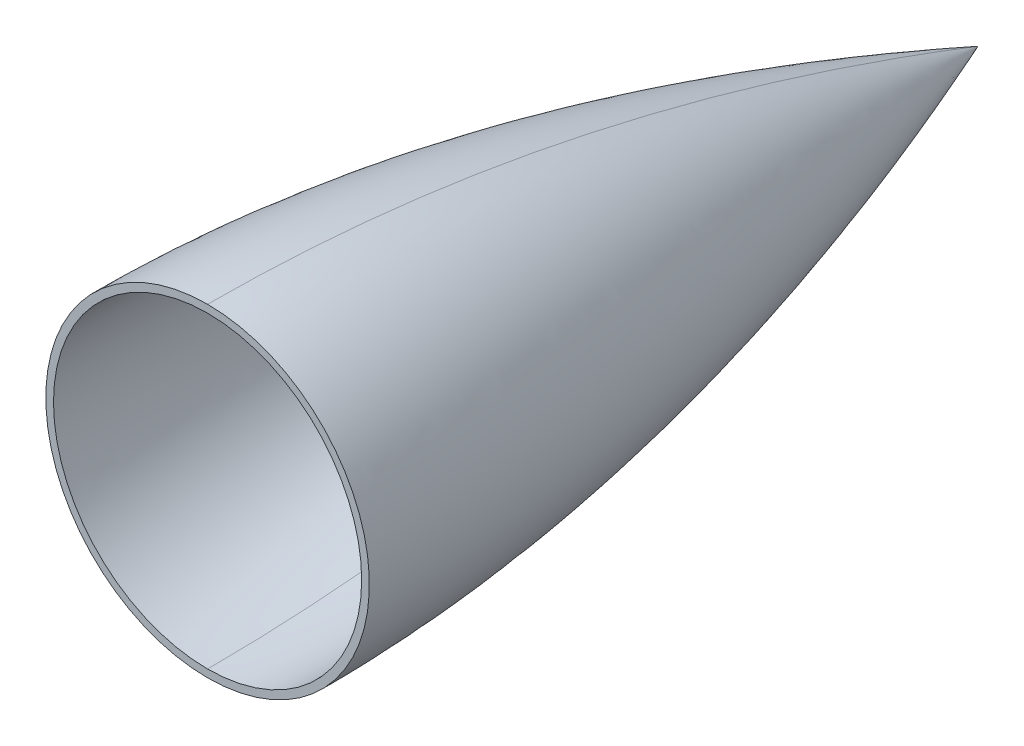
ISO-10303-21;
HEADER;
FILE_DESCRIPTION(('STEP AP214'),'2;1');
FILE_NAME('part.step','',(''),(''),'','','');
FILE_SCHEMA(('AUTOMOTIVE_DESIGN { 1 0 10303 214 1 1 1 1 }'));
ENDSEC;
DATA;
#1=APPLICATION_CONTEXT('core data for automotive mechanical design processes');
#2=APPLICATION_PROTOCOL_DEFINITION('international standard','automotive_design',2000,#1);
#3=PRODUCT_CONTEXT('',#1,'mechanical');
#4=PRODUCT('Part','Part','',(#3));
#5=PRODUCT_RELATED_PRODUCT_CATEGORY('part','',(#4));
#6=PRODUCT_DEFINITION_FORMATION('','',#4);
#7=PRODUCT_DEFINITION_CONTEXT('part definition',#1,'design');
#8=PRODUCT_DEFINITION('design','',#6,#7);
#9=PRODUCT_DEFINITION_SHAPE('','',#8);
#10=(LENGTH_UNIT() NAMED_UNIT(*) SI_UNIT(.MILLI.,.METRE.));
#11=(NAMED_UNIT(*) PLANE_ANGLE_UNIT() SI_UNIT($,.RADIAN.));
#12=(NAMED_UNIT(*) SI_UNIT($,.STERADIAN.) SOLID_ANGLE_UNIT());
#13=UNCERTAINTY_MEASURE_WITH_UNIT(LENGTH_MEASURE(1.E-05),#10,'distance_accuracy_value','');
#14=(GEOMETRIC_REPRESENTATION_CONTEXT(3) GLOBAL_UNCERTAINTY_ASSIGNED_CONTEXT((#13)) GLOBAL_UNIT_ASSIGNED_CONTEXT((#10,
#11,#12)) REPRESENTATION_CONTEXT('',''));
#15=CARTESIAN_POINT('',(0.,0.,0.));
#16=DIRECTION('',(0.,0.,1.));
#17=DIRECTION('',(1.,0.,0.));
#18=AXIS2_PLACEMENT_3D('',#15,#16,#17);
#19=CARTESIAN_POINT('',(-8.,-17.9999999839829,-90.0000000060439));
#20=DIRECTION('',(0.,-1.77968750847413E-10,1.));
#21=DIRECTION('',(0.,-1.,-1.77968750847413E-10));
#22=AXIS2_PLACEMENT_3D('',#19,#20,#21);
#23=CYLINDRICAL_SURFACE('',#22,1.5);
#24=DIRECTION('',(0.,-1.77967594365095E-10,1.));
#25=VECTOR('',#24,1.);
#26=CARTESIAN_POINT('',(-8.,-16.4999999839829,-90.0000000057769));
#27=LINE('',#26,#25);
#28=CARTESIAN_POINT('',(-8.,-16.4999999839829,-90.0000000057769));
#29=VERTEX_POINT('',#28);
#30=CARTESIAN_POINT('',(-8.,-16.4999999848728,-85.0000000057769));
#31=VERTEX_POINT('',#30);
#32=EDGE_CURVE('E163',#29,#31,#27,.T.);
#33=ORIENTED_EDGE('',*,*,#32,.F.);
#34=CARTESIAN_POINT('',(-8.,-17.9999999839829,-90.0000000060439));
#35=DIRECTION('',(0.,-1.77968750847413E-10,1.));
#36=DIRECTION('',(0.,-1.,-1.77968750847413E-10));
#37=AXIS2_PLACEMENT_3D('',#34,#35,#36);
#38=CIRCLE('',#37,1.5);
#39=CARTESIAN_POINT('',(-8.,-19.4999999839829,-90.0000000063108));
#40=VERTEX_POINT('',#39);
#41=EDGE_CURVE('E10',#40,#29,#38,.T.);
#42=ORIENTED_EDGE('',*,*,#41,.F.);
#43=DIRECTION('',(0.,-1.77967594365095E-10,1.));
#44=VECTOR('',#43,1.);
#45=CARTESIAN_POINT('',(-8.,-19.4999999839829,-90.0000000063108));
#46=LINE('',#45,#44);
#47=CARTESIAN_POINT('',(-8.,-19.4999999848728,-85.0000000063108));
#48=VERTEX_POINT('',#47);
#49=EDGE_CURVE('E155',#40,#48,#46,.T.);
#50=ORIENTED_EDGE('',*,*,#49,.T.);
#51=CARTESIAN_POINT('',(-8.,-17.9999999848728,-85.0000000060439));
#52=DIRECTION('',(0.,1.77968750847413E-10,-1.));
#53=DIRECTION('',(0.,-1.,-1.77968750847413E-10));
#54=AXIS2_PLACEMENT_3D('',#51,#52,#53);
#55=CIRCLE('',#54,1.5);
#56=EDGE_CURVE('E141',#31,#48,#55,.T.);
#57=ORIENTED_EDGE('',*,*,#56,.F.);
#58=EDGE_LOOP('',(#33,#42,#50,#57));
#59=FACE_BOUND('',#58,.T.);
#60=ADVANCED_FACE('F16',(#59),#23,.F.);
#61=CARTESIAN_POINT('',(0.,1.60170822374376E-08,-90.0000000028405));
#62=DIRECTION('',(0.,-1.77967577619409E-10,1.));
#63=DIRECTION('',(-1.,0.,0.));
#64=AXIS2_PLACEMENT_3D('',#61,#62,#63);
#65=PLANE('',#64);
#66=ORIENTED_EDGE('',*,*,#41,.T.);
#67=CARTESIAN_POINT('',(-8.,-17.9999999839829,-90.0000000060439));
#68=DIRECTION('',(0.,-1.77968750847413E-10,1.));
#69=DIRECTION('',(0.,-1.,-1.77968750847413E-10));
#70=AXIS2_PLACEMENT_3D('',#67,#68,#69);
#71=CIRCLE('',#70,1.5);
#72=EDGE_CURVE('E170',#29,#40,#71,.T.);
#73=ORIENTED_EDGE('',*,*,#72,.T.);
#74=EDGE_LOOP('',(#66,#73));
#75=FACE_BOUND('',#74,.T.);
#76=ADVANCED_FACE('F300',(#75),#65,.T.);
#77=CARTESIAN_POINT('',(8.,18.0000000160171,-89.9999999996371));
#78=DIRECTION('',(0.,-1.77968750847413E-10,1.));
#79=DIRECTION('',(0.,-1.,-1.77968750847413E-10));
#80=AXIS2_PLACEMENT_3D('',#77,#78,#79);
#81=CYLINDRICAL_SURFACE('',#80,1.5);
#82=DIRECTION('',(0.,-1.77967594365095E-10,1.));
#83=VECTOR('',#82,1.);
#84=CARTESIAN_POINT('',(8.,19.5000000160171,-89.9999999993701));
#85=LINE('',#84,#83);
#86=CARTESIAN_POINT('',(8.,19.5000000160171,-89.9999999993701));
#87=VERTEX_POINT('',#86);
#88=CARTESIAN_POINT('',(8.,19.5000000151272,-84.9999999993701));
#89=VERTEX_POINT('',#88);
#90=EDGE_CURVE('E218',#87,#89,#85,.T.);
#91=ORIENTED_EDGE('',*,*,#90,.F.);
#92=CARTESIAN_POINT('',(8.,18.0000000160171,-89.9999999996371));
#93=DIRECTION('',(0.,-1.77968750847413E-10,1.));
#94=DIRECTION('',(0.,-1.,-1.77968750847413E-10));
#95=AXIS2_PLACEMENT_3D('',#92,#93,#94);
#96=CIRCLE('',#95,1.5);
#97=CARTESIAN_POINT('',(8.,16.5000000160171,-89.999999999904));
#98=VERTEX_POINT('',#97);
#99=EDGE_CURVE('E29',#98,#87,#96,.T.);
#100=ORIENTED_EDGE('',*,*,#99,.F.);
#101=DIRECTION('',(0.,-1.77967594365095E-10,1.));
#102=VECTOR('',#101,1.);
#103=CARTESIAN_POINT('',(8.,16.5000000160171,-89.999999999904));
#104=LINE('',#103,#102);
#105=CARTESIAN_POINT('',(8.,16.5000000151273,-84.999999999904));
#106=VERTEX_POINT('',#105);
#107=EDGE_CURVE('E212',#98,#106,#104,.T.);
#108=ORIENTED_EDGE('',*,*,#107,.T.);
#109=CARTESIAN_POINT('',(8.,18.0000000151272,-84.999999999637));
#110=DIRECTION('',(0.,1.77968750847413E-10,-1.));
#111=DIRECTION('',(0.,-1.,-1.77968750847413E-10));
#112=AXIS2_PLACEMENT_3D('',#109,#110,#111);
#113=CIRCLE('',#112,1.5);
#114=EDGE_CURVE('E77',#89,#106,#113,.T.);
#115=ORIENTED_EDGE('',*,*,#114,.F.);
#116=EDGE_LOOP('',(#91,#100,#108,#115));
#117=FACE_BOUND('',#116,.T.);
#118=ADVANCED_FACE('F18',(#117),#81,.F.);
#119=CARTESIAN_POINT('',(0.,1.60170822374376E-08,-90.0000000028405));
#120=DIRECTION('',(0.,-1.77967577619409E-10,1.));
#121=DIRECTION('',(-1.,0.,0.));
#122=AXIS2_PLACEMENT_3D('',#119,#120,#121);
#123=PLANE('',#122);
#124=ORIENTED_EDGE('',*,*,#99,.T.);
#125=CARTESIAN_POINT('',(8.,18.0000000160171,-89.9999999996371));
#126=DIRECTION('',(0.,-1.77968750847413E-10,1.));
#127=DIRECTION('',(0.,-1.,-1.77968750847413E-10));
#128=AXIS2_PLACEMENT_3D('',#125,#126,#127);
#129=CIRCLE('',#128,1.5);
#130=EDGE_CURVE('E160',#87,#98,#129,.T.);
#131=ORIENTED_EDGE('',*,*,#130,.T.);
#132=EDGE_LOOP('',(#124,#131));
#133=FACE_BOUND('',#132,.T.);
#134=ADVANCED_FACE('F318',(#133),#123,.T.);
#135=CARTESIAN_POINT('',(8.,-17.9999999839829,-90.0000000060439));
#136=DIRECTION('',(0.,-1.77968750847413E-10,1.));
#137=DIRECTION('',(0.,-1.,-1.77968750847413E-10));
#138=AXIS2_PLACEMENT_3D('',#135,#136,#137);
#139=CYLINDRICAL_SURFACE('',#138,1.5);
#140=DIRECTION('',(0.,-1.77967594365095E-10,1.));
#141=VECTOR('',#140,1.);
#142=CARTESIAN_POINT('',(8.,-16.4999999839829,-90.0000000057769));
#143=LINE('',#142,#141);
#144=CARTESIAN_POINT('',(8.,-16.4999999839829,-90.0000000057769));
#145=VERTEX_POINT('',#144);
#146=CARTESIAN_POINT('',(8.,-16.4999999848728,-85.0000000057769));
#147=VERTEX_POINT('',#146);
#148=EDGE_CURVE('E179',#145,#147,#143,.T.);
#149=ORIENTED_EDGE('',*,*,#148,.F.);
#150=CARTESIAN_POINT('',(8.,-17.9999999839829,-90.0000000060439));
#151=DIRECTION('',(0.,-1.77968750847413E-10,1.));
#152=DIRECTION('',(0.,-1.,-1.77968750847413E-10));
#153=AXIS2_PLACEMENT_3D('',#150,#151,#152);
#154=CIRCLE('',#153,1.5);
#155=CARTESIAN_POINT('',(8.,-19.4999999839829,-90.0000000063108));
#156=VERTEX_POINT('',#155);
#157=EDGE_CURVE('E191',#156,#145,#154,.T.);
#158=ORIENTED_EDGE('',*,*,#157,.F.);
#159=DIRECTION('',(0.,-1.77967594365095E-10,1.));
#160=VECTOR('',#159,1.);
#161=CARTESIAN_POINT('',(8.,-19.4999999839829,-90.0000000063108));
#162=LINE('',#161,#160);
#163=CARTESIAN_POINT('',(8.,-19.4999999848728,-85.0000000063108));
#164=VERTEX_POINT('',#163);
#165=EDGE_CURVE('E178',#156,#164,#162,.T.);
#166=ORIENTED_EDGE('',*,*,#165,.T.);
#167=CARTESIAN_POINT('',(8.,-17.9999999848728,-85.0000000060439));
#168=DIRECTION('',(0.,1.77968750847413E-10,-1.));
#169=DIRECTION('',(0.,-1.,-1.77968750847413E-10));
#170=AXIS2_PLACEMENT_3D('',#167,#168,#169);
#171=CIRCLE('',#170,1.5);
#172=EDGE_CURVE('E153',#147,#164,#171,.T.);
#173=ORIENTED_EDGE('',*,*,#172,.F.);
#174=EDGE_LOOP('',(#149,#158,#166,#173));
#175=FACE_BOUND('',#174,.T.);
#176=ADVANCED_FACE('F314',(#175),#139,.F.);
#177=CARTESIAN_POINT('',(0.,1.60170822374376E-08,-90.0000000028405));
#178=DIRECTION('',(0.,-1.77967577619409E-10,1.));
#179=DIRECTION('',(-1.,0.,0.));
#180=AXIS2_PLACEMENT_3D('',#177,#178,#179);
#181=PLANE('',#180);
#182=ORIENTED_EDGE('',*,*,#157,.T.);
#183=CARTESIAN_POINT('',(8.,-17.9999999839829,-90.0000000060439));
#184=DIRECTION('',(0.,-1.77968750847413E-10,1.));
#185=DIRECTION('',(0.,-1.,-1.77968750847413E-10));
#186=AXIS2_PLACEMENT_3D('',#183,#184,#185);
#187=CIRCLE('',#186,1.5);
#188=EDGE_CURVE('E199',#145,#156,#187,.T.);
#189=ORIENTED_EDGE('',*,*,#188,.T.);
#190=EDGE_LOOP('',(#182,#189));
#191=FACE_BOUND('',#190,.T.);
#192=ADVANCED_FACE('F317',(#191),#181,.T.);
#193=CARTESIAN_POINT('',(-8.,18.0000000160171,-89.9999999996371));
#194=DIRECTION('',(0.,-1.77968750847413E-10,1.));
#195=DIRECTION('',(0.,-1.,-1.77968750847413E-10));
#196=AXIS2_PLACEMENT_3D('',#193,#194,#195);
#197=CYLINDRICAL_SURFACE('',#196,1.5);
#198=DIRECTION('',(0.,-1.77967594365095E-10,1.));
#199=VECTOR('',#198,1.);
#200=CARTESIAN_POINT('',(-8.,19.5000000160171,-89.9999999993701));
#201=LINE('',#200,#199);
#202=CARTESIAN_POINT('',(-8.,19.5000000160171,-89.9999999993701));
#203=VERTEX_POINT('',#202);
#204=CARTESIAN_POINT('',(-8.,19.5000000151272,-84.9999999993701));
#205=VERTEX_POINT('',#204);
#206=EDGE_CURVE('E226',#203,#205,#201,.T.);
#207=ORIENTED_EDGE('',*,*,#206,.F.);
#208=CARTESIAN_POINT('',(-8.,18.0000000160171,-89.9999999996371));
#209=DIRECTION('',(0.,-1.77968750847413E-10,1.));
#210=DIRECTION('',(0.,-1.,-1.77968750847413E-10));
#211=AXIS2_PLACEMENT_3D('',#208,#209,#210);
#212=CIRCLE('',#211,1.5);
#213=CARTESIAN_POINT('',(-8.,16.5000000160171,-89.999999999904));
#214=VERTEX_POINT('',#213);
#215=EDGE_CURVE('E194',#214,#203,#212,.T.);
#216=ORIENTED_EDGE('',*,*,#215,.F.);
#217=DIRECTION('',(0.,-1.77967594365095E-10,1.));
#218=VECTOR('',#217,1.);
#219=CARTESIAN_POINT('',(-8.,16.5000000160171,-89.999999999904));
#220=LINE('',#219,#218);
#221=CARTESIAN_POINT('',(-8.,16.5000000151273,-84.999999999904));
#222=VERTEX_POINT('',#221);
#223=EDGE_CURVE('E186',#214,#222,#220,.T.);
#224=ORIENTED_EDGE('',*,*,#223,.T.);
#225=CARTESIAN_POINT('',(-8.,18.0000000151272,-84.999999999637));
#226=DIRECTION('',(0.,1.77968750847413E-10,-1.));
#227=DIRECTION('',(0.,-1.,-1.77968750847413E-10));
#228=AXIS2_PLACEMENT_3D('',#225,#226,#227);
#229=CIRCLE('',#228,1.5);
#230=EDGE_CURVE('E43',#205,#222,#229,.T.);
#231=ORIENTED_EDGE('',*,*,#230,.F.);
#232=EDGE_LOOP('',(#207,#216,#224,#231));
#233=FACE_BOUND('',#232,.T.);
#234=ADVANCED_FACE('F312',(#233),#197,.F.);
#235=CARTESIAN_POINT('',(0.,1.60170822374376E-08,-90.0000000028405));
#236=DIRECTION('',(0.,-1.77967577619409E-10,1.));
#237=DIRECTION('',(-1.,0.,0.));
#238=AXIS2_PLACEMENT_3D('',#235,#236,#237);
#239=PLANE('',#238);
#240=ORIENTED_EDGE('',*,*,#215,.T.);
#241=CARTESIAN_POINT('',(-8.,18.0000000160171,-89.9999999996371));
#242=DIRECTION('',(0.,-1.77968750847413E-10,1.));
#243=DIRECTION('',(0.,-1.,-1.77968750847413E-10));
#244=AXIS2_PLACEMENT_3D('',#241,#242,#243);
#245=CIRCLE('',#244,1.5);
#246=EDGE_CURVE('E230',#203,#214,#245,.T.);
#247=ORIENTED_EDGE('',*,*,#246,.T.);
#248=EDGE_LOOP('',(#240,#247));
#249=FACE_BOUND('',#248,.T.);
#250=ADVANCED_FACE('F309',(#249),#239,.T.);
#251=CARTESIAN_POINT('',(0.,42.,0.));
#252=CARTESIAN_POINT('',(-83.9999999999999,42.,0.));
#253=CARTESIAN_POINT('',(-83.9999999999999,-42.,0.));
#254=CARTESIAN_POINT('',(0.,-42.,0.));
#255=CARTESIAN_POINT('',(0.,42.,-92.1954445729289));
#256=CARTESIAN_POINT('',(-83.9999999999999,42.,-92.1954445729288));
#257=CARTESIAN_POINT('',(-83.9999999999999,-42.,-92.1954445729288));
#258=CARTESIAN_POINT('',(0.,-42.,-92.1954445729289));
#259=CARTESIAN_POINT('',(0.,0.,-200.));
#260=CARTESIAN_POINT('',(0.,0.,-200.));
#261=CARTESIAN_POINT('',(0.,0.,-200.));
#262=CARTESIAN_POINT('',(0.,0.,-200.));
#263=(BOUNDED_SURFACE() B_SPLINE_SURFACE(2,3,((#251,#252,#253,#254),(#255,#256,#257,#258),(#259,
#260,#261,#262)),.UNSPECIFIED.,.F.,.F.,.F.) B_SPLINE_SURFACE_WITH_KNOTS((3,3),(4,4),(0.,1.),(0.,
1.),.UNSPECIFIED.) GEOMETRIC_REPRESENTATION_ITEM() RATIONAL_B_SPLINE_SURFACE(((1.,
0.333333333333334,0.333333333333334,1.),(1.,0.333333333333334,0.333333333333334,1.),(1.,
0.333333333333334,0.333333333333334,1.))) REPRESENTATION_ITEM('') SURFACE());
#264=CARTESIAN_POINT('',(0.,-42.,1.11022302462516E-13));
#265=CARTESIAN_POINT('',(0.,-42.,-92.1954445729289));
#266=CARTESIAN_POINT('',(0.,0.,-200.));
#267=B_SPLINE_CURVE_WITH_KNOTS('',2,(#264,#265,#266),.UNSPECIFIED.,.F.,.F.,(3,3),(0.,1.),.UNSPECIFIED.);
#268=CARTESIAN_POINT('',(0.,-42.,1.11022302462516E-13));
#269=VERTEX_POINT('',#268);
#270=CARTESIAN_POINT('',(0.,0.,-200.));
#271=VERTEX_POINT('',#270);
#272=EDGE_CURVE('E20',#269,#271,#267,.T.);
#273=CARTESIAN_POINT('',(0.,0.,1.11022302462516E-13));
#274=DIRECTION('',(0.,0.,1.));
#275=DIRECTION('',(1.,0.,0.));
#276=AXIS2_PLACEMENT_3D('',#273,#274,#275);
#277=CIRCLE('',#276,42.);
#278=CARTESIAN_POINT('',(0.,42.,1.11022302462516E-13));
#279=VERTEX_POINT('',#278);
#280=EDGE_CURVE('E204',#279,#269,#277,.T.);
#281=CARTESIAN_POINT('',(0.,42.,1.11022302462516E-13));
#282=CARTESIAN_POINT('',(0.,42.,-92.1954445729289));
#283=CARTESIAN_POINT('',(0.,0.,-200.));
#284=B_SPLINE_CURVE_WITH_KNOTS('',2,(#281,#282,#283),.UNSPECIFIED.,.F.,.F.,(3,3),(0.,1.),.UNSPECIFIED.);
#285=EDGE_CURVE('E210',#279,#271,#284,.T.);
#286=ORIENTED_EDGE('',*,*,#272,.F.);
#287=ORIENTED_EDGE('',*,*,#280,.F.);
#288=ORIENTED_EDGE('',*,*,#285,.T.);
#289=EDGE_LOOP('',(#286,#287,#288));
#290=FACE_BOUND('',#289,.T.);
#291=ADVANCED_FACE('F280',(#290),#263,.T.);
#292=CARTESIAN_POINT('',(0.,-40.,0.));
#293=CARTESIAN_POINT('',(79.9999999999999,-40.,0.));
#294=CARTESIAN_POINT('',(80.,39.9999999999999,0.));
#295=CARTESIAN_POINT('',(0.,40.,0.));
#296=CARTESIAN_POINT('',(0.,-40.,-40.8863371627364));
#297=CARTESIAN_POINT('',(80.,-40.,-40.8863371627363));
#298=CARTESIAN_POINT('',(80.,40.,-40.8863371627363));
#299=CARTESIAN_POINT('',(0.,40.,-40.8863371627364));
#300=CARTESIAN_POINT('',(0.,-31.9261407071482,-85.0000000163603));
#301=CARTESIAN_POINT('',(63.8522814142965,-31.9261407071483,-85.0000000163603));
#302=CARTESIAN_POINT('',(63.8522814142965,31.9261407071482,-85.0000000163603));
#303=CARTESIAN_POINT('',(0.,31.9261407071482,-85.0000000163603));
#304=(BOUNDED_SURFACE() B_SPLINE_SURFACE(2,3,((#292,#293,#294,#295),(#296,#297,#298,#299),(#300,
#301,#302,#303)),.UNSPECIFIED.,.F.,.F.,.F.) B_SPLINE_SURFACE_WITH_KNOTS((3,3),(4,4),(0.,
0.449273282447659),(0.,1.),
.UNSPECIFIED.) GEOMETRIC_REPRESENTATION_ITEM() RATIONAL_B_SPLINE_SURFACE(((1.,0.333333333333334,
0.333333333333334,1.),(1.,0.333333333333334,0.333333333333334,1.),(1.,0.333333333333334,
0.333333333333334,1.))) REPRESENTATION_ITEM('') SURFACE());
#305=CARTESIAN_POINT('',(0.,-40.,1.11022302462516E-13));
#306=CARTESIAN_POINT('',(0.,-40.,-40.8863371627386));
#307=CARTESIAN_POINT('',(0.,-31.9261406798426,-85.0000000113627));
#308=B_SPLINE_CURVE_WITH_KNOTS('',2,(#305,#306,#307),.UNSPECIFIED.,.F.,.F.,(3,3),(0.,
0.449273282447683),.UNSPECIFIED.);
#309=CARTESIAN_POINT('',(0.,-40.,1.11022302462516E-13));
#310=VERTEX_POINT('',#309);
#311=CARTESIAN_POINT('',(0.,-31.9261406798426,-85.0000000113627));
#312=VERTEX_POINT('',#311);
#313=EDGE_CURVE('E185',#310,#312,#308,.T.);
#314=CARTESIAN_POINT('',(0.,0.,1.11022302462516E-13));
#315=DIRECTION('',(0.,0.,1.));
#316=DIRECTION('',(1.,0.,0.));
#317=AXIS2_PLACEMENT_3D('',#314,#315,#316);
#318=CIRCLE('',#317,40.);
#319=CARTESIAN_POINT('',(0.,40.,1.11022302462516E-13));
#320=VERTEX_POINT('',#319);
#321=EDGE_CURVE('E201',#310,#320,#318,.T.);
#322=CARTESIAN_POINT('',(0.,40.,1.11022302462516E-13));
#323=CARTESIAN_POINT('',(0.,40.,-40.8863371551601));
#324=CARTESIAN_POINT('',(0.,31.926140710097,-84.9999999999991));
#325=B_SPLINE_CURVE_WITH_KNOTS('',2,(#322,#323,#324),.UNSPECIFIED.,.F.,.F.,(3,3),(0.,
0.449273282364409),.UNSPECIFIED.);
#326=CARTESIAN_POINT('',(0.,31.926140710097,-84.9999999999991));
#327=VERTEX_POINT('',#326);
#328=EDGE_CURVE('E184',#320,#327,#325,.T.);
#329=CARTESIAN_POINT('',(0.,1.51272485084552E-08,-85.0000000056809));
#330=DIRECTION('',(0.,1.77967521442233E-10,-1.));
#331=DIRECTION('',(0.,1.,1.77967521442233E-10));
#332=AXIS2_PLACEMENT_3D('',#329,#330,#331);
#333=CIRCLE('',#332,31.9261406949698);
#334=EDGE_CURVE('E189',#327,#312,#333,.T.);
#335=ORIENTED_EDGE('',*,*,#313,.F.);
#336=ORIENTED_EDGE('',*,*,#321,.T.);
#337=ORIENTED_EDGE('',*,*,#328,.T.);
#338=ORIENTED_EDGE('',*,*,#334,.T.);
#339=EDGE_LOOP('',(#335,#336,#337,#338));
#340=FACE_BOUND('',#339,.T.);
#341=ADVANCED_FACE('F284',(#340),#304,.F.);
#342=CARTESIAN_POINT('',(0.,0.,1.05442089406587E-13));
#343=DIRECTION('',(0.,0.,1.));
#344=DIRECTION('',(1.,0.,0.));
#345=AXIS2_PLACEMENT_3D('',#342,#343,#344);
#346=PLANE('',#345);
#347=CARTESIAN_POINT('',(0.,0.,1.11022302462516E-13));
#348=DIRECTION('',(0.,0.,1.));
#349=DIRECTION('',(1.,0.,0.));
#350=AXIS2_PLACEMENT_3D('',#347,#348,#349);
#351=CIRCLE('',#350,40.);
#352=EDGE_CURVE('E207',#320,#310,#351,.T.);
#353=ORIENTED_EDGE('',*,*,#352,.F.);
#354=ORIENTED_EDGE('',*,*,#321,.F.);
#355=EDGE_LOOP('',(#353,#354));
#356=FACE_BOUND('',#355,.T.);
#357=ORIENTED_EDGE('',*,*,#280,.T.);
#358=CARTESIAN_POINT('',(0.,0.,1.11022302462516E-13));
#359=DIRECTION('',(0.,0.,1.));
#360=DIRECTION('',(1.,0.,0.));
#361=AXIS2_PLACEMENT_3D('',#358,#359,#360);
#362=CIRCLE('',#361,42.);
#363=EDGE_CURVE('E231',#269,#279,#362,.T.);
#364=ORIENTED_EDGE('',*,*,#363,.T.);
#365=EDGE_LOOP('',(#357,#364));
#366=FACE_BOUND('',#365,.T.);
#367=ADVANCED_FACE('F282',(#356,#366),#346,.T.);
#368=CARTESIAN_POINT('',(0.,31.926140710097,-84.9999999971586));
#369=DIRECTION('',(0.,-1.77967629499344E-10,1.));
#370=DIRECTION('',(-1.,0.,0.));
#371=AXIS2_PLACEMENT_3D('',#368,#369,#370);
#372=PLANE('',#371);
#373=CARTESIAN_POINT('',(8.,18.0000000151272,-84.999999999637));
#374=DIRECTION('',(0.,1.77968750847413E-10,-1.));
#375=DIRECTION('',(0.,-1.,-1.77968750847413E-10));
#376=AXIS2_PLACEMENT_3D('',#373,#374,#375);
#377=CIRCLE('',#376,1.5);
#378=EDGE_CURVE('E215',#106,#89,#377,.T.);
#379=ORIENTED_EDGE('',*,*,#378,.T.);
#380=ORIENTED_EDGE('',*,*,#114,.T.);
#381=EDGE_LOOP('',(#379,#380));
#382=FACE_BOUND('',#381,.T.);
#383=CARTESIAN_POINT('',(-8.,18.0000000151272,-84.999999999637));
#384=DIRECTION('',(0.,1.77968750847413E-10,-1.));
#385=DIRECTION('',(0.,-1.,-1.77968750847413E-10));
#386=AXIS2_PLACEMENT_3D('',#383,#384,#385);
#387=CIRCLE('',#386,1.5);
#388=EDGE_CURVE('E190',#222,#205,#387,.T.);
#389=ORIENTED_EDGE('',*,*,#388,.T.);
#390=ORIENTED_EDGE('',*,*,#230,.T.);
#391=EDGE_LOOP('',(#389,#390));
#392=FACE_BOUND('',#391,.T.);
#393=CARTESIAN_POINT('',(-8.,-17.9999999848728,-85.0000000060439));
#394=DIRECTION('',(0.,1.77968750847413E-10,-1.));
#395=DIRECTION('',(0.,-1.,-1.77968750847413E-10));
#396=AXIS2_PLACEMENT_3D('',#393,#394,#395);
#397=CIRCLE('',#396,1.5);
#398=EDGE_CURVE('E150',#48,#31,#397,.T.);
#399=ORIENTED_EDGE('',*,*,#398,.T.);
#400=ORIENTED_EDGE('',*,*,#56,.T.);
#401=EDGE_LOOP('',(#399,#400));
#402=FACE_BOUND('',#401,.T.);
#403=CARTESIAN_POINT('',(8.,-17.9999999848728,-85.0000000060439));
#404=DIRECTION('',(0.,1.77968750847413E-10,-1.));
#405=DIRECTION('',(0.,-1.,-1.77968750847413E-10));
#406=AXIS2_PLACEMENT_3D('',#403,#404,#405);
#407=CIRCLE('',#406,1.5);
#408=EDGE_CURVE('E174',#164,#147,#407,.T.);
#409=ORIENTED_EDGE('',*,*,#408,.T.);
#410=ORIENTED_EDGE('',*,*,#172,.T.);
#411=EDGE_LOOP('',(#409,#410));
#412=FACE_BOUND('',#411,.T.);
#413=ORIENTED_EDGE('',*,*,#334,.F.);
#414=CARTESIAN_POINT('',(0.,1.51272485084552E-08,-85.0000000056809));
#415=DIRECTION('',(0.,1.77967521442233E-10,-1.));
#416=DIRECTION('',(0.,1.,1.77967521442233E-10));
#417=AXIS2_PLACEMENT_3D('',#414,#415,#416);
#418=CIRCLE('',#417,31.9261406949698);
#419=EDGE_CURVE('E180',#312,#327,#418,.T.);
#420=ORIENTED_EDGE('',*,*,#419,.F.);
#421=EDGE_LOOP('',(#413,#420));
#422=FACE_BOUND('',#421,.T.);
#423=ADVANCED_FACE('F147',(#382,#392,#402,#412,#422),#372,.T.);
#424=CARTESIAN_POINT('',(-8.,18.0000000160171,-89.9999999996371));
#425=DIRECTION('',(0.,-1.77968750847413E-10,1.));
#426=DIRECTION('',(0.,-1.,-1.77968750847413E-10));
#427=AXIS2_PLACEMENT_3D('',#424,#425,#426);
#428=CYLINDRICAL_SURFACE('',#427,1.5);
#429=ORIENTED_EDGE('',*,*,#246,.F.);
#430=ORIENTED_EDGE('',*,*,#206,.T.);
#431=ORIENTED_EDGE('',*,*,#388,.F.);
#432=ORIENTED_EDGE('',*,*,#223,.F.);
#433=EDGE_LOOP('',(#429,#430,#431,#432));
#434=FACE_BOUND('',#433,.T.);
#435=ADVANCED_FACE('F292',(#434),#428,.F.);
#436=CARTESIAN_POINT('',(8.,-17.9999999839829,-90.0000000060439));
#437=DIRECTION('',(0.,-1.77968750847413E-10,1.));
#438=DIRECTION('',(0.,-1.,-1.77968750847413E-10));
#439=AXIS2_PLACEMENT_3D('',#436,#437,#438);
#440=CYLINDRICAL_SURFACE('',#439,1.5);
#441=ORIENTED_EDGE('',*,*,#188,.F.);
#442=ORIENTED_EDGE('',*,*,#148,.T.);
#443=ORIENTED_EDGE('',*,*,#408,.F.);
#444=ORIENTED_EDGE('',*,*,#165,.F.);
#445=EDGE_LOOP('',(#441,#442,#443,#444));
#446=FACE_BOUND('',#445,.T.);
#447=ADVANCED_FACE('F352',(#446),#440,.F.);
#448=CARTESIAN_POINT('',(8.,18.0000000160171,-89.9999999996371));
#449=DIRECTION('',(0.,-1.77968750847413E-10,1.));
#450=DIRECTION('',(0.,-1.,-1.77968750847413E-10));
#451=AXIS2_PLACEMENT_3D('',#448,#449,#450);
#452=CYLINDRICAL_SURFACE('',#451,1.5);
#453=ORIENTED_EDGE('',*,*,#130,.F.);
#454=ORIENTED_EDGE('',*,*,#90,.T.);
#455=ORIENTED_EDGE('',*,*,#378,.F.);
#456=ORIENTED_EDGE('',*,*,#107,.F.);
#457=EDGE_LOOP('',(#453,#454,#455,#456));
#458=FACE_BOUND('',#457,.T.);
#459=ADVANCED_FACE('F345',(#458),#452,.F.);
#460=CARTESIAN_POINT('',(-8.,-17.9999999839829,-90.0000000060439));
#461=DIRECTION('',(0.,-1.77968750847413E-10,1.));
#462=DIRECTION('',(0.,-1.,-1.77968750847413E-10));
#463=AXIS2_PLACEMENT_3D('',#460,#461,#462);
#464=CYLINDRICAL_SURFACE('',#463,1.5);
#465=ORIENTED_EDGE('',*,*,#72,.F.);
#466=ORIENTED_EDGE('',*,*,#32,.T.);
#467=ORIENTED_EDGE('',*,*,#398,.F.);
#468=ORIENTED_EDGE('',*,*,#49,.F.);
#469=EDGE_LOOP('',(#465,#466,#467,#468));
#470=FACE_BOUND('',#469,.T.);
#471=ADVANCED_FACE('F162',(#470),#464,.F.);
#472=CARTESIAN_POINT('',(0.,40.,0.));
#473=CARTESIAN_POINT('',(-79.9999999999999,40.,0.));
#474=CARTESIAN_POINT('',(-79.9999999999999,-40.,0.));
#475=CARTESIAN_POINT('',(0.,-40.,0.));
#476=CARTESIAN_POINT('',(0.,40.,-40.8863371627364));
#477=CARTESIAN_POINT('',(-80.,40.,-40.8863371627363));
#478=CARTESIAN_POINT('',(-80.,-40.,-40.8863371627363));
#479=CARTESIAN_POINT('',(0.,-40.,-40.8863371627364));
#480=CARTESIAN_POINT('',(0.,31.9261407071482,-85.0000000163603));
#481=CARTESIAN_POINT('',(-63.8522814142965,31.9261407071483,-85.0000000163603));
#482=CARTESIAN_POINT('',(-63.8522814142965,-31.9261407071482,-85.0000000163603));
#483=CARTESIAN_POINT('',(0.,-31.9261407071482,-85.0000000163603));
#484=(BOUNDED_SURFACE() B_SPLINE_SURFACE(2,3,((#472,#473,#474,#475),(#476,#477,#478,#479),(#480,
#481,#482,#483)),.UNSPECIFIED.,.F.,.F.,.F.) B_SPLINE_SURFACE_WITH_KNOTS((3,3),(4,4),(0.,
0.449273282447659),(0.,1.),
.UNSPECIFIED.) GEOMETRIC_REPRESENTATION_ITEM() RATIONAL_B_SPLINE_SURFACE(((1.,0.333333333333334,
0.333333333333334,1.),(1.,0.333333333333334,0.333333333333334,1.),(1.,0.333333333333334,
0.333333333333334,1.))) REPRESENTATION_ITEM('') SURFACE());
#485=ORIENTED_EDGE('',*,*,#352,.T.);
#486=ORIENTED_EDGE('',*,*,#313,.T.);
#487=ORIENTED_EDGE('',*,*,#419,.T.);
#488=ORIENTED_EDGE('',*,*,#328,.F.);
#489=EDGE_LOOP('',(#485,#486,#487,#488));
#490=FACE_BOUND('',#489,.T.);
#491=ADVANCED_FACE('F338',(#490),#484,.F.);
#492=CARTESIAN_POINT('',(0.,-42.,0.));
#493=CARTESIAN_POINT('',(83.9999999999999,-42.,0.));
#494=CARTESIAN_POINT('',(83.9999999999999,42.,0.));
#495=CARTESIAN_POINT('',(0.,42.,0.));
#496=CARTESIAN_POINT('',(0.,-42.,-92.1954445729289));
#497=CARTESIAN_POINT('',(83.9999999999999,-42.,-92.1954445729288));
#498=CARTESIAN_POINT('',(83.9999999999999,42.,-92.1954445729288));
#499=CARTESIAN_POINT('',(0.,42.,-92.1954445729289));
#500=CARTESIAN_POINT('',(0.,0.,-200.));
#501=CARTESIAN_POINT('',(0.,0.,-200.));
#502=CARTESIAN_POINT('',(0.,0.,-200.));
#503=CARTESIAN_POINT('',(0.,0.,-200.));
#504=(BOUNDED_SURFACE() B_SPLINE_SURFACE(2,3,((#492,#493,#494,#495),(#496,#497,#498,#499),(#500,
#501,#502,#503)),.UNSPECIFIED.,.F.,.F.,.F.) B_SPLINE_SURFACE_WITH_KNOTS((3,3),(4,4),(0.,1.),(0.,
1.),.UNSPECIFIED.) GEOMETRIC_REPRESENTATION_ITEM() RATIONAL_B_SPLINE_SURFACE(((1.,
0.333333333333334,0.333333333333334,1.),(1.,0.333333333333334,0.333333333333334,1.),(1.,
0.333333333333334,0.333333333333334,1.))) REPRESENTATION_ITEM('') SURFACE());
#505=ORIENTED_EDGE('',*,*,#363,.F.);
#506=ORIENTED_EDGE('',*,*,#272,.T.);
#507=ORIENTED_EDGE('',*,*,#285,.F.);
#508=EDGE_LOOP('',(#505,#506,#507));
#509=FACE_BOUND('',#508,.T.);
#510=ADVANCED_FACE('F279',(#509),#504,.T.);
#511=CLOSED_SHELL('',(#60,#76,#118,#134,#176,#192,#234,#250,#291,#341,#367,#423,#435,#447,#459,
#471,#491,#510));
#512=MANIFOLD_SOLID_BREP('B1',#511);
#513=ADVANCED_BREP_SHAPE_REPRESENTATION('',(#18,#512),#14);
#514=SHAPE_DEFINITION_REPRESENTATION(#9,#513);
ENDSEC;
END-ISO-10303-21;
